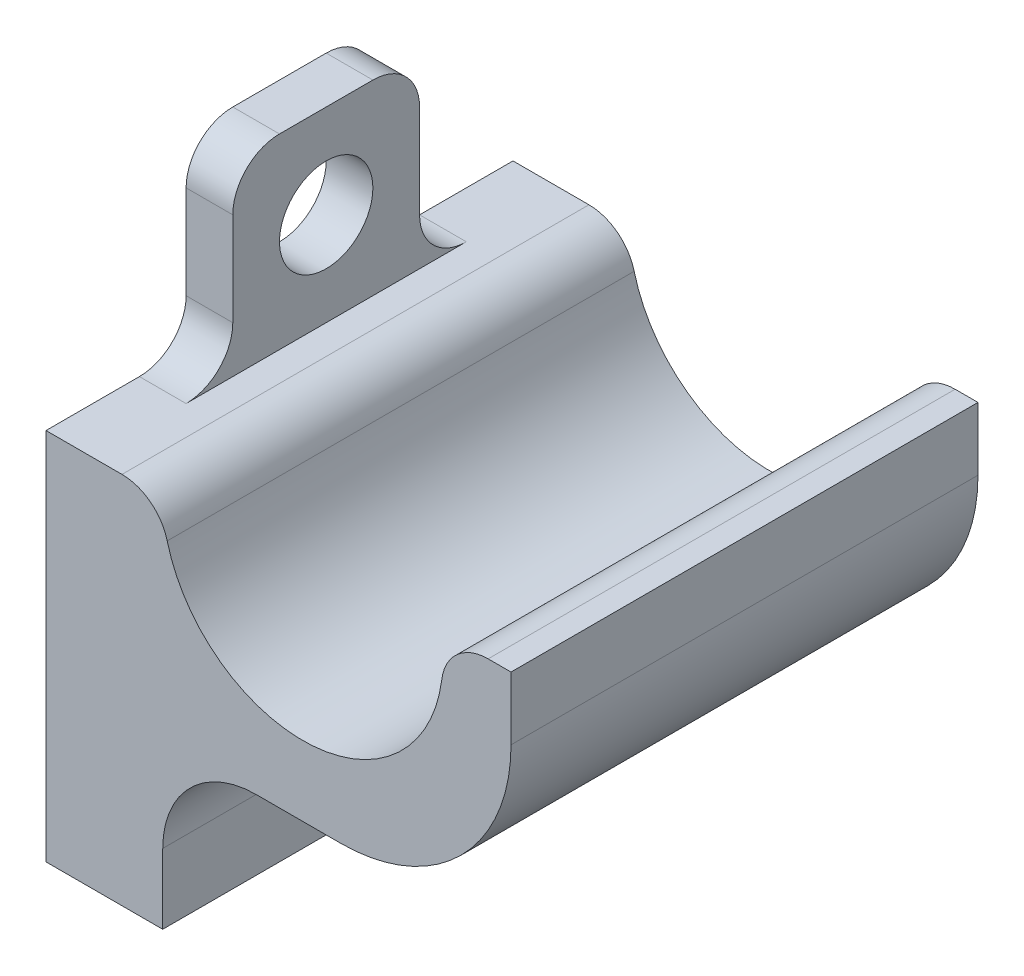
ISO-10303-21;
HEADER;
FILE_DESCRIPTION(('STEP AP214'),'2;1');
FILE_NAME('part.step','',(''),(''),'','','');
FILE_SCHEMA(('AUTOMOTIVE_DESIGN { 1 0 10303 214 1 1 1 1 }'));
ENDSEC;
DATA;
#1=APPLICATION_CONTEXT('core data for automotive mechanical design processes');
#2=APPLICATION_PROTOCOL_DEFINITION('international standard','automotive_design',2000,#1);
#3=PRODUCT_CONTEXT('',#1,'mechanical');
#4=PRODUCT('Part','Part','',(#3));
#5=PRODUCT_RELATED_PRODUCT_CATEGORY('part','',(#4));
#6=PRODUCT_DEFINITION_FORMATION('','',#4);
#7=PRODUCT_DEFINITION_CONTEXT('part definition',#1,'design');
#8=PRODUCT_DEFINITION('design','',#6,#7);
#9=PRODUCT_DEFINITION_SHAPE('','',#8);
#10=(LENGTH_UNIT() NAMED_UNIT(*) SI_UNIT(.MILLI.,.METRE.));
#11=(NAMED_UNIT(*) PLANE_ANGLE_UNIT() SI_UNIT($,.RADIAN.));
#12=(NAMED_UNIT(*) SI_UNIT($,.STERADIAN.) SOLID_ANGLE_UNIT());
#13=UNCERTAINTY_MEASURE_WITH_UNIT(LENGTH_MEASURE(1.E-05),#10,'distance_accuracy_value','');
#14=(GEOMETRIC_REPRESENTATION_CONTEXT(3) GLOBAL_UNCERTAINTY_ASSIGNED_CONTEXT((#13)) GLOBAL_UNIT_ASSIGNED_CONTEXT((#10,
#11,#12)) REPRESENTATION_CONTEXT('',''));
#15=CARTESIAN_POINT('',(0.,0.,0.));
#16=DIRECTION('',(0.,0.,1.));
#17=DIRECTION('',(1.,0.,0.));
#18=AXIS2_PLACEMENT_3D('',#15,#16,#17);
#19=CARTESIAN_POINT('',(23.9609708303066,20.3103702384589,-10.));
#20=DIRECTION('',(0.,1.,0.));
#21=DIRECTION('',(0.,0.,1.));
#22=AXIS2_PLACEMENT_3D('',#19,#20,#21);
#23=PLANE('',#22);
#24=DIRECTION('',(0.,0.,1.));
#25=VECTOR('',#24,1.);
#26=CARTESIAN_POINT('',(23.9609708303066,20.3103702384589,-10.));
#27=LINE('',#26,#25);
#28=CARTESIAN_POINT('',(23.9609708303066,20.3103702384589,-10.));
#29=VERTEX_POINT('',#28);
#30=CARTESIAN_POINT('',(23.9609708303066,20.3103702384589,-6.));
#31=VERTEX_POINT('',#30);
#32=EDGE_CURVE('E277',#29,#31,#27,.T.);
#33=ORIENTED_EDGE('',*,*,#32,.T.);
#34=DIRECTION('',(-1.,0.,0.));
#35=VECTOR('',#34,1.);
#36=CARTESIAN_POINT('',(23.9609708303066,20.3103702384589,-6.));
#37=LINE('',#36,#35);
#38=CARTESIAN_POINT('',(25.9609708303066,20.3103702384589,-6.));
#39=VERTEX_POINT('',#38);
#40=EDGE_CURVE('E352',#31,#39,#37,.F.);
#41=ORIENTED_EDGE('',*,*,#40,.T.);
#42=DIRECTION('',(0.,0.,-1.));
#43=VECTOR('',#42,1.);
#44=CARTESIAN_POINT('',(25.9609708303066,20.3103702384589,4.));
#45=LINE('',#44,#43);
#46=CARTESIAN_POINT('',(25.9609708303066,20.3103702384589,6.));
#47=VERTEX_POINT('',#46);
#48=EDGE_CURVE('E47',#47,#39,#45,.T.);
#49=ORIENTED_EDGE('',*,*,#48,.F.);
#50=DIRECTION('',(1.,0.,0.));
#51=VECTOR('',#50,1.);
#52=CARTESIAN_POINT('',(23.9609708303066,20.3103702384589,6.));
#53=LINE('',#52,#51);
#54=CARTESIAN_POINT('',(23.9609708303066,20.3103702384589,6.));
#55=VERTEX_POINT('',#54);
#56=EDGE_CURVE('E350',#47,#55,#53,.F.);
#57=ORIENTED_EDGE('',*,*,#56,.T.);
#58=CARTESIAN_POINT('',(23.9609708303066,20.3103702384589,10.));
#59=VERTEX_POINT('',#58);
#60=EDGE_CURVE('E280',#55,#59,#27,.T.);
#61=ORIENTED_EDGE('',*,*,#60,.T.);
#62=DIRECTION('',(-1.,0.,0.));
#63=VECTOR('',#62,1.);
#64=CARTESIAN_POINT('',(23.9609708303066,20.3103702384589,10.));
#65=LINE('',#64,#63);
#66=CARTESIAN_POINT('',(27.2150041378918,20.3103702384589,10.));
#67=VERTEX_POINT('',#66);
#68=EDGE_CURVE('E248',#67,#59,#65,.T.);
#69=ORIENTED_EDGE('',*,*,#68,.F.);
#70=DIRECTION('',(0.,0.,1.));
#71=VECTOR('',#70,1.);
#72=CARTESIAN_POINT('',(27.2150041378918,20.3103702384589,-10.));
#73=LINE('',#72,#71);
#74=CARTESIAN_POINT('',(27.2150041378918,20.3103702384589,-10.));
#75=VERTEX_POINT('',#74);
#76=EDGE_CURVE('E317',#67,#75,#73,.F.);
#77=ORIENTED_EDGE('',*,*,#76,.T.);
#78=DIRECTION('',(-1.,0.,0.));
#79=VECTOR('',#78,1.);
#80=CARTESIAN_POINT('',(23.9609708303066,20.3103702384589,-10.));
#81=LINE('',#80,#79);
#82=EDGE_CURVE('E270',#75,#29,#81,.T.);
#83=ORIENTED_EDGE('',*,*,#82,.T.);
#84=EDGE_LOOP('',(#33,#41,#49,#57,#61,#69,#77,#83));
#85=FACE_BOUND('',#84,.T.);
#86=ADVANCED_FACE('F32',(#85),#23,.T.);
#87=CARTESIAN_POINT('',(28.9609708303066,4.31037023845893,-10.));
#88=DIRECTION('',(1.,0.,0.));
#89=DIRECTION('',(0.,0.,-1.));
#90=AXIS2_PLACEMENT_3D('',#87,#88,#89);
#91=PLANE('',#90);
#92=DIRECTION('',(0.,-1.,0.));
#93=VECTOR('',#92,1.);
#94=CARTESIAN_POINT('',(28.9609708303066,4.31037023845893,2.));
#95=LINE('',#94,#93);
#96=CARTESIAN_POINT('',(28.9609708303066,7.31037023845893,2.));
#97=VERTEX_POINT('',#96);
#98=CARTESIAN_POINT('',(28.9609708303066,4.31037023845893,2.));
#99=VERTEX_POINT('',#98);
#100=EDGE_CURVE('E189',#97,#99,#95,.T.);
#101=ORIENTED_EDGE('',*,*,#100,.F.);
#102=DIRECTION('',(0.,0.,1.));
#103=VECTOR('',#102,1.);
#104=CARTESIAN_POINT('',(28.9609708303066,7.31037023845893,10.));
#105=LINE('',#104,#103);
#106=CARTESIAN_POINT('',(28.9609708303066,7.31037023845893,10.));
#107=VERTEX_POINT('',#106);
#108=EDGE_CURVE('E292',#97,#107,#105,.T.);
#109=ORIENTED_EDGE('',*,*,#108,.T.);
#110=DIRECTION('',(0.,1.,0.));
#111=VECTOR('',#110,1.);
#112=CARTESIAN_POINT('',(28.9609708303066,4.31037023845893,10.));
#113=LINE('',#112,#111);
#114=CARTESIAN_POINT('',(28.9609708303066,4.31037023845893,10.));
#115=VERTEX_POINT('',#114);
#116=EDGE_CURVE('E218',#115,#107,#113,.T.);
#117=ORIENTED_EDGE('',*,*,#116,.F.);
#118=DIRECTION('',(0.,0.,1.));
#119=VECTOR('',#118,1.);
#120=CARTESIAN_POINT('',(28.9609708303066,4.31037023845893,-10.));
#121=LINE('',#120,#119);
#122=EDGE_CURVE('E215',#99,#115,#121,.T.);
#123=ORIENTED_EDGE('',*,*,#122,.F.);
#124=EDGE_LOOP('',(#101,#109,#117,#123));
#125=FACE_BOUND('',#124,.T.);
#126=ADVANCED_FACE('F216',(#125),#91,.T.);
#127=CARTESIAN_POINT('',(23.9609708303066,4.31037023845893,-10.));
#128=DIRECTION('',(0.,-1.,0.));
#129=DIRECTION('',(0.,0.,-1.));
#130=AXIS2_PLACEMENT_3D('',#127,#128,#129);
#131=PLANE('',#130);
#132=CARTESIAN_POINT('',(28.9609708303066,4.31037023845893,-10.));
#133=VERTEX_POINT('',#132);
#134=CARTESIAN_POINT('',(28.9609708303066,4.31037023845893,-2.));
#135=VERTEX_POINT('',#134);
#136=EDGE_CURVE('E222',#133,#135,#121,.T.);
#137=ORIENTED_EDGE('',*,*,#136,.T.);
#138=DIRECTION('',(0.,0.,1.));
#139=VECTOR('',#138,1.);
#140=CARTESIAN_POINT('',(28.9609708303066,4.31037023845893,-2.));
#141=LINE('',#140,#139);
#142=EDGE_CURVE('E208',#135,#99,#141,.T.);
#143=ORIENTED_EDGE('',*,*,#142,.T.);
#144=ORIENTED_EDGE('',*,*,#122,.T.);
#145=DIRECTION('',(1.,0.,0.));
#146=VECTOR('',#145,1.);
#147=CARTESIAN_POINT('',(23.9609708303066,4.31037023845893,10.));
#148=LINE('',#147,#146);
#149=CARTESIAN_POINT('',(23.9609708303066,4.31037023845893,10.));
#150=VERTEX_POINT('',#149);
#151=EDGE_CURVE('E230',#150,#115,#148,.T.);
#152=ORIENTED_EDGE('',*,*,#151,.F.);
#153=DIRECTION('',(0.,0.,1.));
#154=VECTOR('',#153,1.);
#155=CARTESIAN_POINT('',(23.9609708303066,4.31037023845893,-10.));
#156=LINE('',#155,#154);
#157=CARTESIAN_POINT('',(23.9609708303066,4.31037023845893,-10.));
#158=VERTEX_POINT('',#157);
#159=EDGE_CURVE('E274',#158,#150,#156,.T.);
#160=ORIENTED_EDGE('',*,*,#159,.F.);
#161=DIRECTION('',(1.,0.,0.));
#162=VECTOR('',#161,1.);
#163=CARTESIAN_POINT('',(23.9609708303066,4.31037023845893,-10.));
#164=LINE('',#163,#162);
#165=EDGE_CURVE('E254',#158,#133,#164,.T.);
#166=ORIENTED_EDGE('',*,*,#165,.T.);
#167=EDGE_LOOP('',(#137,#143,#144,#152,#160,#166));
#168=FACE_BOUND('',#167,.T.);
#169=ADVANCED_FACE('F226',(#168),#131,.T.);
#170=CARTESIAN_POINT('',(23.9609708303066,4.31037023845893,-10.));
#171=DIRECTION('',(-1.,0.,0.));
#172=DIRECTION('',(0.,0.,1.));
#173=AXIS2_PLACEMENT_3D('',#170,#171,#172);
#174=PLANE('',#173);
#175=CARTESIAN_POINT('',(23.9609708303066,24.3103702384589,0.));
#176=DIRECTION('',(-1.,0.,0.));
#177=DIRECTION('',(0.,0.,1.));
#178=AXIS2_PLACEMENT_3D('',#175,#176,#177);
#179=CIRCLE('',#178,2.);
#180=CARTESIAN_POINT('',(23.9609708303066,24.3103702384589,2.));
#181=VERTEX_POINT('',#180);
#182=EDGE_CURVE('E688',#181,#181,#179,.F.);
#183=ORIENTED_EDGE('',*,*,#182,.T.);
#184=EDGE_LOOP('',(#183));
#185=FACE_BOUND('',#184,.T.);
#186=DIRECTION('',(0.,-1.,0.));
#187=VECTOR('',#186,1.);
#188=CARTESIAN_POINT('',(23.9609708303066,28.3103702384589,4.));
#189=LINE('',#188,#187);
#190=CARTESIAN_POINT('',(23.9609708303066,26.3103702384589,4.));
#191=VERTEX_POINT('',#190);
#192=CARTESIAN_POINT('',(23.9609708303066,22.3103702384589,4.));
#193=VERTEX_POINT('',#192);
#194=EDGE_CURVE('E399',#191,#193,#189,.T.);
#195=ORIENTED_EDGE('',*,*,#194,.F.);
#196=CARTESIAN_POINT('',(23.9609708303066,26.3103702384589,2.));
#197=DIRECTION('',(-1.,0.,0.));
#198=DIRECTION('',(0.,0.,1.));
#199=AXIS2_PLACEMENT_3D('',#196,#197,#198);
#200=CIRCLE('',#199,2.);
#201=CARTESIAN_POINT('',(23.9609708303066,28.3103702384589,2.));
#202=VERTEX_POINT('',#201);
#203=EDGE_CURVE('E343',#191,#202,#200,.T.);
#204=ORIENTED_EDGE('',*,*,#203,.T.);
#205=DIRECTION('',(0.,0.,1.));
#206=VECTOR('',#205,1.);
#207=CARTESIAN_POINT('',(23.9609708303066,28.3103702384589,-4.));
#208=LINE('',#207,#206);
#209=CARTESIAN_POINT('',(23.9609708303066,28.3103702384589,-2.));
#210=VERTEX_POINT('',#209);
#211=EDGE_CURVE('E699',#210,#202,#208,.T.);
#212=ORIENTED_EDGE('',*,*,#211,.F.);
#213=CARTESIAN_POINT('',(23.9609708303066,26.3103702384589,-2.));
#214=DIRECTION('',(-1.,0.,0.));
#215=DIRECTION('',(0.,0.,1.));
#216=AXIS2_PLACEMENT_3D('',#213,#214,#215);
#217=CIRCLE('',#216,2.);
#218=CARTESIAN_POINT('',(23.9609708303066,26.3103702384589,-4.));
#219=VERTEX_POINT('',#218);
#220=EDGE_CURVE('E341',#210,#219,#217,.T.);
#221=ORIENTED_EDGE('',*,*,#220,.T.);
#222=DIRECTION('',(0.,-1.,0.));
#223=VECTOR('',#222,1.);
#224=CARTESIAN_POINT('',(23.9609708303066,28.3103702384589,-4.));
#225=LINE('',#224,#223);
#226=CARTESIAN_POINT('',(23.9609708303066,22.3103702384589,-4.));
#227=VERTEX_POINT('',#226);
#228=EDGE_CURVE('E396',#219,#227,#225,.T.);
#229=ORIENTED_EDGE('',*,*,#228,.T.);
#230=CARTESIAN_POINT('',(23.9609708303066,22.3103702384589,-6.));
#231=DIRECTION('',(-1.,0.,0.));
#232=DIRECTION('',(0.,0.,1.));
#233=AXIS2_PLACEMENT_3D('',#230,#231,#232);
#234=CIRCLE('',#233,2.);
#235=EDGE_CURVE('E354',#227,#31,#234,.F.);
#236=ORIENTED_EDGE('',*,*,#235,.T.);
#237=ORIENTED_EDGE('',*,*,#32,.F.);
#238=DIRECTION('',(0.,-1.,0.));
#239=VECTOR('',#238,1.);
#240=CARTESIAN_POINT('',(23.9609708303066,4.31037023845893,-10.));
#241=LINE('',#240,#239);
#242=EDGE_CURVE('E223',#29,#158,#241,.T.);
#243=ORIENTED_EDGE('',*,*,#242,.T.);
#244=ORIENTED_EDGE('',*,*,#159,.T.);
#245=DIRECTION('',(0.,-1.,0.));
#246=VECTOR('',#245,1.);
#247=CARTESIAN_POINT('',(23.9609708303066,4.31037023845893,10.));
#248=LINE('',#247,#246);
#249=EDGE_CURVE('E251',#59,#150,#248,.T.);
#250=ORIENTED_EDGE('',*,*,#249,.F.);
#251=ORIENTED_EDGE('',*,*,#60,.F.);
#252=CARTESIAN_POINT('',(23.9609708303066,22.3103702384589,6.));
#253=DIRECTION('',(-1.,0.,0.));
#254=DIRECTION('',(0.,0.,1.));
#255=AXIS2_PLACEMENT_3D('',#252,#253,#254);
#256=CIRCLE('',#255,2.);
#257=EDGE_CURVE('E11',#55,#193,#256,.F.);
#258=ORIENTED_EDGE('',*,*,#257,.T.);
#259=EDGE_LOOP('',(#195,#204,#212,#221,#229,#236,#237,#243,#244,#250,#251,#258));
#260=FACE_BOUND('',#259,.T.);
#261=ADVANCED_FACE('F371',(#185,#260),#174,.T.);
#262=CARTESIAN_POINT('',(34.9609708303066,20.3103702384589,-10.));
#263=DIRECTION('',(0.,0.,1.));
#264=DIRECTION('',(1.,0.,0.));
#265=AXIS2_PLACEMENT_3D('',#262,#263,#264);
#266=CYLINDRICAL_SURFACE('',#265,6.);
#267=CARTESIAN_POINT('',(34.9609708303066,20.3103702384589,-10.));
#268=DIRECTION('',(0.,0.,-1.));
#269=DIRECTION('',(1.,0.,0.));
#270=AXIS2_PLACEMENT_3D('',#267,#268,#269);
#271=CIRCLE('',#270,6.);
#272=CARTESIAN_POINT('',(40.9139112802019,19.5603702384589,-10.));
#273=VERTEX_POINT('',#272);
#274=CARTESIAN_POINT('',(29.1514958109955,18.8103702384589,-10.));
#275=VERTEX_POINT('',#274);
#276=EDGE_CURVE('E267',#273,#275,#271,.T.);
#277=ORIENTED_EDGE('',*,*,#276,.T.);
#278=DIRECTION('',(0.,0.,1.));
#279=VECTOR('',#278,1.);
#280=CARTESIAN_POINT('',(29.1514958109955,18.8103702384589,-10.));
#281=LINE('',#280,#279);
#282=CARTESIAN_POINT('',(29.1514958109955,18.8103702384589,10.));
#283=VERTEX_POINT('',#282);
#284=EDGE_CURVE('E310',#275,#283,#281,.T.);
#285=ORIENTED_EDGE('',*,*,#284,.T.);
#286=CARTESIAN_POINT('',(34.9609708303066,20.3103702384589,10.));
#287=DIRECTION('',(0.,0.,-1.));
#288=DIRECTION('',(1.,0.,0.));
#289=AXIS2_PLACEMENT_3D('',#286,#287,#288);
#290=CIRCLE('',#289,6.);
#291=CARTESIAN_POINT('',(40.9139112802019,19.5603702384589,10.));
#292=VERTEX_POINT('',#291);
#293=EDGE_CURVE('E245',#292,#283,#290,.T.);
#294=ORIENTED_EDGE('',*,*,#293,.F.);
#295=DIRECTION('',(0.,0.,1.));
#296=VECTOR('',#295,1.);
#297=CARTESIAN_POINT('',(40.9139112802019,19.5603702384589,-10.));
#298=LINE('',#297,#296);
#299=EDGE_CURVE('E308',#292,#273,#298,.F.);
#300=ORIENTED_EDGE('',*,*,#299,.T.);
#301=EDGE_LOOP('',(#277,#285,#294,#300));
#302=FACE_BOUND('',#301,.T.);
#303=ADVANCED_FACE('F438',(#302),#266,.F.);
#304=CARTESIAN_POINT('',(40.8770506134062,21.3103702384589,-10.));
#305=DIRECTION('',(0.,1.,0.));
#306=DIRECTION('',(0.,0.,1.));
#307=AXIS2_PLACEMENT_3D('',#304,#305,#306);
#308=PLANE('',#307);
#309=DIRECTION('',(-1.,0.,0.));
#310=VECTOR('',#309,1.);
#311=CARTESIAN_POINT('',(40.8770506134062,21.3103702384589,-10.));
#312=LINE('',#311,#310);
#313=CARTESIAN_POINT('',(43.8770506134062,21.3103702384589,-10.));
#314=VERTEX_POINT('',#313);
#315=CARTESIAN_POINT('',(42.8982247635004,21.3103702384589,-10.));
#316=VERTEX_POINT('',#315);
#317=EDGE_CURVE('E264',#314,#316,#312,.T.);
#318=ORIENTED_EDGE('',*,*,#317,.T.);
#319=DIRECTION('',(0.,0.,1.));
#320=VECTOR('',#319,1.);
#321=CARTESIAN_POINT('',(42.8982247635004,21.3103702384589,-10.));
#322=LINE('',#321,#320);
#323=CARTESIAN_POINT('',(42.8982247635004,21.3103702384589,10.));
#324=VERTEX_POINT('',#323);
#325=EDGE_CURVE('E323',#316,#324,#322,.T.);
#326=ORIENTED_EDGE('',*,*,#325,.T.);
#327=DIRECTION('',(-1.,0.,0.));
#328=VECTOR('',#327,1.);
#329=CARTESIAN_POINT('',(40.8770506134062,21.3103702384589,10.));
#330=LINE('',#329,#328);
#331=CARTESIAN_POINT('',(43.8770506134062,21.3103702384589,10.));
#332=VERTEX_POINT('',#331);
#333=EDGE_CURVE('E242',#332,#324,#330,.T.);
#334=ORIENTED_EDGE('',*,*,#333,.F.);
#335=DIRECTION('',(0.,0.,1.));
#336=VECTOR('',#335,1.);
#337=CARTESIAN_POINT('',(43.8770506134062,21.3103702384589,-10.));
#338=LINE('',#337,#336);
#339=EDGE_CURVE('E281',#314,#332,#338,.T.);
#340=ORIENTED_EDGE('',*,*,#339,.F.);
#341=EDGE_LOOP('',(#318,#326,#334,#340));
#342=FACE_BOUND('',#341,.T.);
#343=ADVANCED_FACE('F432',(#342),#308,.T.);
#344=CARTESIAN_POINT('',(43.8770506134062,11.3103702384589,-10.));
#345=DIRECTION('',(1.,0.,0.));
#346=DIRECTION('',(0.,0.,-1.));
#347=AXIS2_PLACEMENT_3D('',#344,#345,#346);
#348=PLANE('',#347);
#349=DIRECTION('',(0.,1.,0.));
#350=VECTOR('',#349,1.);
#351=CARTESIAN_POINT('',(43.8770506134062,11.3103702384589,10.));
#352=LINE('',#351,#350);
#353=CARTESIAN_POINT('',(43.8770506134062,18.6103702384589,10.));
#354=VERTEX_POINT('',#353);
#355=EDGE_CURVE('E240',#354,#332,#352,.T.);
#356=ORIENTED_EDGE('',*,*,#355,.F.);
#357=DIRECTION('',(0.,0.,1.));
#358=VECTOR('',#357,1.);
#359=CARTESIAN_POINT('',(43.8770506134062,18.6103702384589,-10.));
#360=LINE('',#359,#358);
#361=CARTESIAN_POINT('',(43.8770506134062,18.6103702384589,-10.));
#362=VERTEX_POINT('',#361);
#363=EDGE_CURVE('E304',#354,#362,#360,.F.);
#364=ORIENTED_EDGE('',*,*,#363,.T.);
#365=DIRECTION('',(0.,1.,0.));
#366=VECTOR('',#365,1.);
#367=CARTESIAN_POINT('',(43.8770506134062,11.3103702384589,-10.));
#368=LINE('',#367,#366);
#369=EDGE_CURVE('E262',#362,#314,#368,.T.);
#370=ORIENTED_EDGE('',*,*,#369,.T.);
#371=ORIENTED_EDGE('',*,*,#339,.T.);
#372=EDGE_LOOP('',(#356,#364,#370,#371));
#373=FACE_BOUND('',#372,.T.);
#374=ADVANCED_FACE('F426',(#373),#348,.T.);
#375=CARTESIAN_POINT('',(28.9609708303066,11.3103702384589,-10.));
#376=DIRECTION('',(0.,-1.,0.));
#377=DIRECTION('',(0.,0.,-1.));
#378=AXIS2_PLACEMENT_3D('',#375,#376,#377);
#379=PLANE('',#378);
#380=DIRECTION('',(1.,0.,0.));
#381=VECTOR('',#380,1.);
#382=CARTESIAN_POINT('',(28.9609708303066,11.3103702384589,-10.));
#383=LINE('',#382,#381);
#384=CARTESIAN_POINT('',(32.9609708303066,11.3103702384589,-10.));
#385=VERTEX_POINT('',#384);
#386=CARTESIAN_POINT('',(36.5770506134062,11.3103702384589,-10.));
#387=VERTEX_POINT('',#386);
#388=EDGE_CURVE('E259',#385,#387,#383,.T.);
#389=ORIENTED_EDGE('',*,*,#388,.T.);
#390=DIRECTION('',(0.,0.,1.));
#391=VECTOR('',#390,1.);
#392=CARTESIAN_POINT('',(36.5770506134062,11.3103702384589,-10.));
#393=LINE('',#392,#391);
#394=CARTESIAN_POINT('',(36.5770506134062,11.3103702384589,10.));
#395=VERTEX_POINT('',#394);
#396=EDGE_CURVE('E299',#387,#395,#393,.T.);
#397=ORIENTED_EDGE('',*,*,#396,.T.);
#398=DIRECTION('',(1.,0.,0.));
#399=VECTOR('',#398,1.);
#400=CARTESIAN_POINT('',(28.9609708303066,11.3103702384589,10.));
#401=LINE('',#400,#399);
#402=CARTESIAN_POINT('',(32.9609708303066,11.3103702384589,10.));
#403=VERTEX_POINT('',#402);
#404=EDGE_CURVE('E237',#403,#395,#401,.T.);
#405=ORIENTED_EDGE('',*,*,#404,.F.);
#406=DIRECTION('',(0.,0.,1.));
#407=VECTOR('',#406,1.);
#408=CARTESIAN_POINT('',(32.9609708303066,11.3103702384589,2.));
#409=LINE('',#408,#407);
#410=CARTESIAN_POINT('',(32.9609708303066,11.3103702384589,2.));
#411=VERTEX_POINT('',#410);
#412=EDGE_CURVE('E288',#403,#411,#409,.F.);
#413=ORIENTED_EDGE('',*,*,#412,.T.);
#414=DIRECTION('',(-1.,0.,0.));
#415=VECTOR('',#414,1.);
#416=CARTESIAN_POINT('',(36.4190107218564,11.3103702384589,2.));
#417=LINE('',#416,#415);
#418=CARTESIAN_POINT('',(36.4190107218564,11.3103702384589,2.));
#419=VERTEX_POINT('',#418);
#420=EDGE_CURVE('E201',#419,#411,#417,.T.);
#421=ORIENTED_EDGE('',*,*,#420,.F.);
#422=DIRECTION('',(0.,0.,1.));
#423=VECTOR('',#422,1.);
#424=CARTESIAN_POINT('',(36.4190107218564,11.3103702384589,-2.));
#425=LINE('',#424,#423);
#426=CARTESIAN_POINT('',(36.4190107218564,11.3103702384589,-2.));
#427=VERTEX_POINT('',#426);
#428=EDGE_CURVE('E211',#427,#419,#425,.T.);
#429=ORIENTED_EDGE('',*,*,#428,.F.);
#430=DIRECTION('',(-1.,0.,0.));
#431=VECTOR('',#430,1.);
#432=CARTESIAN_POINT('',(36.4190107218564,11.3103702384589,-2.));
#433=LINE('',#432,#431);
#434=CARTESIAN_POINT('',(32.9609708303066,11.3103702384589,-2.));
#435=VERTEX_POINT('',#434);
#436=EDGE_CURVE('E212',#427,#435,#433,.T.);
#437=ORIENTED_EDGE('',*,*,#436,.T.);
#438=DIRECTION('',(0.,0.,1.));
#439=VECTOR('',#438,1.);
#440=CARTESIAN_POINT('',(32.9609708303066,11.3103702384589,-10.));
#441=LINE('',#440,#439);
#442=EDGE_CURVE('E290',#435,#385,#441,.F.);
#443=ORIENTED_EDGE('',*,*,#442,.T.);
#444=EDGE_LOOP('',(#389,#397,#405,#413,#421,#429,#437,#443));
#445=FACE_BOUND('',#444,.T.);
#446=ADVANCED_FACE('F412',(#445),#379,.T.);
#447=DIRECTION('',(0.,1.,0.));
#448=VECTOR('',#447,1.);
#449=CARTESIAN_POINT('',(28.9609708303066,4.31037023845893,-10.));
#450=LINE('',#449,#448);
#451=CARTESIAN_POINT('',(28.9609708303066,7.31037023845893,-10.));
#452=VERTEX_POINT('',#451);
#453=EDGE_CURVE('E256',#133,#452,#450,.T.);
#454=ORIENTED_EDGE('',*,*,#453,.T.);
#455=DIRECTION('',(0.,0.,1.));
#456=VECTOR('',#455,1.);
#457=CARTESIAN_POINT('',(28.9609708303066,7.31037023845893,-2.));
#458=LINE('',#457,#456);
#459=CARTESIAN_POINT('',(28.9609708303066,7.31037023845893,-2.));
#460=VERTEX_POINT('',#459);
#461=EDGE_CURVE('E276',#452,#460,#458,.T.);
#462=ORIENTED_EDGE('',*,*,#461,.T.);
#463=DIRECTION('',(0.,-1.,0.));
#464=VECTOR('',#463,1.);
#465=CARTESIAN_POINT('',(28.9609708303066,4.31037023845893,-2.));
#466=LINE('',#465,#464);
#467=EDGE_CURVE('E232',#460,#135,#466,.T.);
#468=ORIENTED_EDGE('',*,*,#467,.T.);
#469=ORIENTED_EDGE('',*,*,#136,.F.);
#470=EDGE_LOOP('',(#454,#462,#468,#469));
#471=FACE_BOUND('',#470,.T.);
#472=ADVANCED_FACE('F407',(#471),#91,.T.);
#473=CARTESIAN_POINT('',(34.9609708303066,20.3103702384589,-10.));
#474=DIRECTION('',(0.,0.,1.));
#475=DIRECTION('',(1.,0.,0.));
#476=AXIS2_PLACEMENT_3D('',#473,#474,#475);
#477=PLANE('',#476);
#478=ORIENTED_EDGE('',*,*,#82,.F.);
#479=CARTESIAN_POINT('',(27.2150041378918,18.3103702384589,-10.));
#480=DIRECTION('',(0.,0.,1.));
#481=DIRECTION('',(1.,0.,0.));
#482=AXIS2_PLACEMENT_3D('',#479,#480,#481);
#483=CIRCLE('',#482,2.);
#484=EDGE_CURVE('E321',#75,#275,#483,.F.);
#485=ORIENTED_EDGE('',*,*,#484,.T.);
#486=ORIENTED_EDGE('',*,*,#276,.F.);
#487=CARTESIAN_POINT('',(42.8982247635004,19.3103702384589,-10.));
#488=DIRECTION('',(0.,0.,1.));
#489=DIRECTION('',(1.,0.,0.));
#490=AXIS2_PLACEMENT_3D('',#487,#488,#489);
#491=CIRCLE('',#490,2.);
#492=EDGE_CURVE('E319',#273,#316,#491,.F.);
#493=ORIENTED_EDGE('',*,*,#492,.T.);
#494=ORIENTED_EDGE('',*,*,#317,.F.);
#495=ORIENTED_EDGE('',*,*,#369,.F.);
#496=CARTESIAN_POINT('',(36.5770506134062,18.6103702384589,-10.));
#497=DIRECTION('',(0.,0.,1.));
#498=DIRECTION('',(1.,0.,0.));
#499=AXIS2_PLACEMENT_3D('',#496,#497,#498);
#500=CIRCLE('',#499,7.3);
#501=EDGE_CURVE('E306',#362,#387,#500,.F.);
#502=ORIENTED_EDGE('',*,*,#501,.T.);
#503=ORIENTED_EDGE('',*,*,#388,.F.);
#504=CARTESIAN_POINT('',(32.9609708303066,7.31037023845893,-10.));
#505=DIRECTION('',(0.,0.,1.));
#506=DIRECTION('',(1.,0.,0.));
#507=AXIS2_PLACEMENT_3D('',#504,#505,#506);
#508=CIRCLE('',#507,4.);
#509=EDGE_CURVE('E295',#385,#452,#508,.T.);
#510=ORIENTED_EDGE('',*,*,#509,.T.);
#511=ORIENTED_EDGE('',*,*,#453,.F.);
#512=ORIENTED_EDGE('',*,*,#165,.F.);
#513=ORIENTED_EDGE('',*,*,#242,.F.);
#514=EDGE_LOOP('',(#478,#485,#486,#493,#494,#495,#502,#503,#510,#511,#512,#513));
#515=FACE_BOUND('',#514,.T.);
#516=ADVANCED_FACE('F380',(#515),#477,.F.);
#517=CARTESIAN_POINT('',(34.9609708303066,20.3103702384589,10.));
#518=DIRECTION('',(0.,0.,1.));
#519=DIRECTION('',(1.,0.,0.));
#520=AXIS2_PLACEMENT_3D('',#517,#518,#519);
#521=PLANE('',#520);
#522=ORIENTED_EDGE('',*,*,#293,.T.);
#523=CARTESIAN_POINT('',(27.2150041378918,18.3103702384589,10.));
#524=DIRECTION('',(0.,0.,1.));
#525=DIRECTION('',(1.,0.,0.));
#526=AXIS2_PLACEMENT_3D('',#523,#524,#525);
#527=CIRCLE('',#526,2.);
#528=EDGE_CURVE('E315',#283,#67,#527,.T.);
#529=ORIENTED_EDGE('',*,*,#528,.T.);
#530=ORIENTED_EDGE('',*,*,#68,.T.);
#531=ORIENTED_EDGE('',*,*,#249,.T.);
#532=ORIENTED_EDGE('',*,*,#151,.T.);
#533=ORIENTED_EDGE('',*,*,#116,.T.);
#534=CARTESIAN_POINT('',(32.9609708303066,7.31037023845893,10.));
#535=DIRECTION('',(0.,0.,1.));
#536=DIRECTION('',(1.,0.,0.));
#537=AXIS2_PLACEMENT_3D('',#534,#535,#536);
#538=CIRCLE('',#537,4.);
#539=EDGE_CURVE('E297',#107,#403,#538,.F.);
#540=ORIENTED_EDGE('',*,*,#539,.T.);
#541=ORIENTED_EDGE('',*,*,#404,.T.);
#542=CARTESIAN_POINT('',(36.5770506134062,18.6103702384589,10.));
#543=DIRECTION('',(0.,0.,1.));
#544=DIRECTION('',(1.,0.,0.));
#545=AXIS2_PLACEMENT_3D('',#542,#543,#544);
#546=CIRCLE('',#545,7.3);
#547=EDGE_CURVE('E302',#395,#354,#546,.T.);
#548=ORIENTED_EDGE('',*,*,#547,.T.);
#549=ORIENTED_EDGE('',*,*,#355,.T.);
#550=ORIENTED_EDGE('',*,*,#333,.T.);
#551=CARTESIAN_POINT('',(42.8982247635004,19.3103702384589,10.));
#552=DIRECTION('',(0.,0.,1.));
#553=DIRECTION('',(1.,0.,0.));
#554=AXIS2_PLACEMENT_3D('',#551,#552,#553);
#555=CIRCLE('',#554,2.);
#556=EDGE_CURVE('E313',#324,#292,#555,.T.);
#557=ORIENTED_EDGE('',*,*,#556,.T.);
#558=EDGE_LOOP('',(#522,#529,#530,#531,#532,#533,#540,#541,#548,#549,#550,#557));
#559=FACE_BOUND('',#558,.T.);
#560=ADVANCED_FACE('F374',(#559),#521,.T.);
#561=CARTESIAN_POINT('',(36.4190107218564,11.3103702384589,-2.));
#562=DIRECTION('',(0.684361840922293,-0.729142558550418,0.));
#563=DIRECTION('',(0.729142558550418,0.684361840922293,0.));
#564=AXIS2_PLACEMENT_3D('',#561,#562,#563);
#565=PLANE('',#564);
#566=ORIENTED_EDGE('',*,*,#428,.T.);
#567=DIRECTION('',(0.729142558550418,0.684361840922293,0.));
#568=VECTOR('',#567,1.);
#569=CARTESIAN_POINT('',(36.4190107218564,11.3103702384589,2.));
#570=LINE('',#569,#568);
#571=EDGE_CURVE('E193',#99,#419,#570,.T.);
#572=ORIENTED_EDGE('',*,*,#571,.F.);
#573=ORIENTED_EDGE('',*,*,#142,.F.);
#574=DIRECTION('',(0.729142558550418,0.684361840922293,0.));
#575=VECTOR('',#574,1.);
#576=CARTESIAN_POINT('',(36.4190107218564,11.3103702384589,-2.));
#577=LINE('',#576,#575);
#578=EDGE_CURVE('E228',#135,#427,#577,.T.);
#579=ORIENTED_EDGE('',*,*,#578,.T.);
#580=EDGE_LOOP('',(#566,#572,#573,#579));
#581=FACE_BOUND('',#580,.T.);
#582=ADVANCED_FACE('F205',(#581),#565,.T.);
#583=CARTESIAN_POINT('',(0.,0.,-2.));
#584=DIRECTION('',(0.,0.,-1.));
#585=DIRECTION('',(-1.,0.,0.));
#586=AXIS2_PLACEMENT_3D('',#583,#584,#585);
#587=PLANE('',#586);
#588=ORIENTED_EDGE('',*,*,#467,.F.);
#589=CARTESIAN_POINT('',(32.9609708303066,7.31037023845893,-2.));
#590=DIRECTION('',(0.,0.,-1.));
#591=DIRECTION('',(-1.,0.,0.));
#592=AXIS2_PLACEMENT_3D('',#589,#590,#591);
#593=CIRCLE('',#592,4.);
#594=EDGE_CURVE('E286',#460,#435,#593,.T.);
#595=ORIENTED_EDGE('',*,*,#594,.T.);
#596=ORIENTED_EDGE('',*,*,#436,.F.);
#597=ORIENTED_EDGE('',*,*,#578,.F.);
#598=EDGE_LOOP('',(#588,#595,#596,#597));
#599=FACE_BOUND('',#598,.T.);
#600=ADVANCED_FACE('F410',(#599),#587,.T.);
#601=CARTESIAN_POINT('',(0.,0.,2.));
#602=DIRECTION('',(0.,0.,-1.));
#603=DIRECTION('',(-1.,0.,0.));
#604=AXIS2_PLACEMENT_3D('',#601,#602,#603);
#605=PLANE('',#604);
#606=ORIENTED_EDGE('',*,*,#420,.T.);
#607=CARTESIAN_POINT('',(32.9609708303066,7.31037023845893,2.));
#608=DIRECTION('',(0.,0.,-1.));
#609=DIRECTION('',(-1.,0.,0.));
#610=AXIS2_PLACEMENT_3D('',#607,#608,#609);
#611=CIRCLE('',#610,4.);
#612=EDGE_CURVE('E196',#411,#97,#611,.F.);
#613=ORIENTED_EDGE('',*,*,#612,.T.);
#614=ORIENTED_EDGE('',*,*,#100,.T.);
#615=ORIENTED_EDGE('',*,*,#571,.T.);
#616=EDGE_LOOP('',(#606,#613,#614,#615));
#617=FACE_BOUND('',#616,.T.);
#618=ADVANCED_FACE('F192',(#617),#605,.F.);
#619=CARTESIAN_POINT('',(32.9609708303066,7.31037023845893,-10.));
#620=DIRECTION('',(0.,0.,-1.));
#621=DIRECTION('',(-1.,0.,0.));
#622=AXIS2_PLACEMENT_3D('',#619,#620,#621);
#623=CYLINDRICAL_SURFACE('',#622,4.);
#624=ORIENTED_EDGE('',*,*,#509,.F.);
#625=ORIENTED_EDGE('',*,*,#442,.F.);
#626=ORIENTED_EDGE('',*,*,#594,.F.);
#627=ORIENTED_EDGE('',*,*,#461,.F.);
#628=EDGE_LOOP('',(#624,#625,#626,#627));
#629=FACE_BOUND('',#628,.T.);
#630=ADVANCED_FACE('F475',(#629),#623,.F.);
#631=CARTESIAN_POINT('',(32.9609708303066,7.31037023845893,-10.));
#632=DIRECTION('',(0.,0.,-1.));
#633=DIRECTION('',(-1.,0.,0.));
#634=AXIS2_PLACEMENT_3D('',#631,#632,#633);
#635=CYLINDRICAL_SURFACE('',#634,4.);
#636=ORIENTED_EDGE('',*,*,#612,.F.);
#637=ORIENTED_EDGE('',*,*,#412,.F.);
#638=ORIENTED_EDGE('',*,*,#539,.F.);
#639=ORIENTED_EDGE('',*,*,#108,.F.);
#640=EDGE_LOOP('',(#636,#637,#638,#639));
#641=FACE_BOUND('',#640,.T.);
#642=ADVANCED_FACE('F417',(#641),#635,.F.);
#643=CARTESIAN_POINT('',(36.5770506134062,18.6103702384589,-10.));
#644=DIRECTION('',(0.,0.,1.));
#645=DIRECTION('',(1.,0.,0.));
#646=AXIS2_PLACEMENT_3D('',#643,#644,#645);
#647=CYLINDRICAL_SURFACE('',#646,7.3);
#648=ORIENTED_EDGE('',*,*,#501,.F.);
#649=ORIENTED_EDGE('',*,*,#363,.F.);
#650=ORIENTED_EDGE('',*,*,#547,.F.);
#651=ORIENTED_EDGE('',*,*,#396,.F.);
#652=EDGE_LOOP('',(#648,#649,#650,#651));
#653=FACE_BOUND('',#652,.T.);
#654=ADVANCED_FACE('F422',(#653),#647,.T.);
#655=CARTESIAN_POINT('',(27.2150041378918,18.3103702384589,-10.));
#656=DIRECTION('',(0.,0.,1.));
#657=DIRECTION('',(1.,0.,0.));
#658=AXIS2_PLACEMENT_3D('',#655,#656,#657);
#659=CYLINDRICAL_SURFACE('',#658,2.);
#660=ORIENTED_EDGE('',*,*,#484,.F.);
#661=ORIENTED_EDGE('',*,*,#76,.F.);
#662=ORIENTED_EDGE('',*,*,#528,.F.);
#663=ORIENTED_EDGE('',*,*,#284,.F.);
#664=EDGE_LOOP('',(#660,#661,#662,#663));
#665=FACE_BOUND('',#664,.T.);
#666=ADVANCED_FACE('F445',(#665),#659,.T.);
#667=CARTESIAN_POINT('',(42.8982247635004,19.3103702384589,-10.));
#668=DIRECTION('',(0.,0.,1.));
#669=DIRECTION('',(1.,0.,0.));
#670=AXIS2_PLACEMENT_3D('',#667,#668,#669);
#671=CYLINDRICAL_SURFACE('',#670,2.);
#672=ORIENTED_EDGE('',*,*,#492,.F.);
#673=ORIENTED_EDGE('',*,*,#299,.F.);
#674=ORIENTED_EDGE('',*,*,#556,.F.);
#675=ORIENTED_EDGE('',*,*,#325,.F.);
#676=EDGE_LOOP('',(#672,#673,#674,#675));
#677=FACE_BOUND('',#676,.T.);
#678=ADVANCED_FACE('F442',(#677),#671,.T.);
#679=CARTESIAN_POINT('',(25.9609708303066,28.3103702384589,4.));
#680=DIRECTION('',(-1.,0.,0.));
#681=DIRECTION('',(0.,0.,1.));
#682=AXIS2_PLACEMENT_3D('',#679,#680,#681);
#683=PLANE('',#682);
#684=CARTESIAN_POINT('',(25.9609708303066,24.3103702384589,0.));
#685=DIRECTION('',(1.,0.,0.));
#686=DIRECTION('',(0.,0.,-1.));
#687=AXIS2_PLACEMENT_3D('',#684,#685,#686);
#688=CIRCLE('',#687,2.);
#689=CARTESIAN_POINT('',(25.9609708303066,24.3103702384589,-2.));
#690=VERTEX_POINT('',#689);
#691=EDGE_CURVE('E691',#690,#690,#688,.T.);
#692=ORIENTED_EDGE('',*,*,#691,.F.);
#693=EDGE_LOOP('',(#692));
#694=FACE_BOUND('',#693,.T.);
#695=DIRECTION('',(0.,0.,-1.));
#696=VECTOR('',#695,1.);
#697=CARTESIAN_POINT('',(25.9609708303066,28.3103702384589,4.));
#698=LINE('',#697,#696);
#699=CARTESIAN_POINT('',(25.9609708303066,28.3103702384589,2.));
#700=VERTEX_POINT('',#699);
#701=CARTESIAN_POINT('',(25.9609708303066,28.3103702384589,-2.));
#702=VERTEX_POINT('',#701);
#703=EDGE_CURVE('E693',#700,#702,#698,.T.);
#704=ORIENTED_EDGE('',*,*,#703,.F.);
#705=CARTESIAN_POINT('',(25.9609708303066,26.3103702384589,2.));
#706=DIRECTION('',(-1.,0.,0.));
#707=DIRECTION('',(0.,0.,1.));
#708=AXIS2_PLACEMENT_3D('',#705,#706,#707);
#709=CIRCLE('',#708,2.);
#710=CARTESIAN_POINT('',(25.9609708303066,26.3103702384589,4.));
#711=VERTEX_POINT('',#710);
#712=EDGE_CURVE('E334',#700,#711,#709,.F.);
#713=ORIENTED_EDGE('',*,*,#712,.T.);
#714=DIRECTION('',(0.,-1.,0.));
#715=VECTOR('',#714,1.);
#716=CARTESIAN_POINT('',(25.9609708303066,28.3103702384589,4.));
#717=LINE('',#716,#715);
#718=CARTESIAN_POINT('',(25.9609708303066,22.3103702384589,4.));
#719=VERTEX_POINT('',#718);
#720=EDGE_CURVE('E362',#711,#719,#717,.T.);
#721=ORIENTED_EDGE('',*,*,#720,.T.);
#722=CARTESIAN_POINT('',(25.9609708303066,22.3103702384589,6.));
#723=DIRECTION('',(-1.,0.,0.));
#724=DIRECTION('',(0.,0.,1.));
#725=AXIS2_PLACEMENT_3D('',#722,#723,#724);
#726=CIRCLE('',#725,2.);
#727=EDGE_CURVE('E40',#719,#47,#726,.T.);
#728=ORIENTED_EDGE('',*,*,#727,.T.);
#729=ORIENTED_EDGE('',*,*,#48,.T.);
#730=CARTESIAN_POINT('',(25.9609708303066,22.3103702384589,-6.));
#731=DIRECTION('',(-1.,0.,0.));
#732=DIRECTION('',(0.,0.,1.));
#733=AXIS2_PLACEMENT_3D('',#730,#731,#732);
#734=CIRCLE('',#733,2.);
#735=CARTESIAN_POINT('',(25.9609708303066,22.3103702384589,-4.));
#736=VERTEX_POINT('',#735);
#737=EDGE_CURVE('E356',#39,#736,#734,.T.);
#738=ORIENTED_EDGE('',*,*,#737,.T.);
#739=DIRECTION('',(0.,-1.,0.));
#740=VECTOR('',#739,1.);
#741=CARTESIAN_POINT('',(25.9609708303066,28.3103702384589,-4.));
#742=LINE('',#741,#740);
#743=CARTESIAN_POINT('',(25.9609708303066,26.3103702384589,-4.));
#744=VERTEX_POINT('',#743);
#745=EDGE_CURVE('E390',#744,#736,#742,.T.);
#746=ORIENTED_EDGE('',*,*,#745,.F.);
#747=CARTESIAN_POINT('',(25.9609708303066,26.3103702384589,-2.));
#748=DIRECTION('',(-1.,0.,0.));
#749=DIRECTION('',(0.,0.,1.));
#750=AXIS2_PLACEMENT_3D('',#747,#748,#749);
#751=CIRCLE('',#750,2.);
#752=EDGE_CURVE('E332',#744,#702,#751,.F.);
#753=ORIENTED_EDGE('',*,*,#752,.T.);
#754=EDGE_LOOP('',(#704,#713,#721,#728,#729,#738,#746,#753));
#755=FACE_BOUND('',#754,.T.);
#756=ADVANCED_FACE('F360',(#694,#755),#683,.F.);
#757=CARTESIAN_POINT('',(25.9609708303066,28.3103702384589,-4.));
#758=DIRECTION('',(0.,0.,1.));
#759=DIRECTION('',(1.,0.,0.));
#760=AXIS2_PLACEMENT_3D('',#757,#758,#759);
#761=PLANE('',#760);
#762=ORIENTED_EDGE('',*,*,#228,.F.);
#763=DIRECTION('',(-1.,0.,0.));
#764=VECTOR('',#763,1.);
#765=CARTESIAN_POINT('',(25.9609708303066,26.3103702384589,-4.));
#766=LINE('',#765,#764);
#767=EDGE_CURVE('E348',#219,#744,#766,.F.);
#768=ORIENTED_EDGE('',*,*,#767,.T.);
#769=ORIENTED_EDGE('',*,*,#745,.T.);
#770=DIRECTION('',(-1.,0.,0.));
#771=VECTOR('',#770,1.);
#772=CARTESIAN_POINT('',(25.9609708303066,22.3103702384589,-4.));
#773=LINE('',#772,#771);
#774=EDGE_CURVE('E345',#736,#227,#773,.T.);
#775=ORIENTED_EDGE('',*,*,#774,.T.);
#776=EDGE_LOOP('',(#762,#768,#769,#775));
#777=FACE_BOUND('',#776,.T.);
#778=ADVANCED_FACE('F394',(#777),#761,.F.);
#779=CARTESIAN_POINT('',(23.9609708303066,28.3103702384589,4.));
#780=DIRECTION('',(0.,0.,-1.));
#781=DIRECTION('',(-1.,0.,0.));
#782=AXIS2_PLACEMENT_3D('',#779,#780,#781);
#783=PLANE('',#782);
#784=ORIENTED_EDGE('',*,*,#720,.F.);
#785=DIRECTION('',(1.,0.,0.));
#786=VECTOR('',#785,1.);
#787=CARTESIAN_POINT('',(23.9609708303066,26.3103702384589,4.));
#788=LINE('',#787,#786);
#789=EDGE_CURVE('E339',#711,#191,#788,.F.);
#790=ORIENTED_EDGE('',*,*,#789,.T.);
#791=ORIENTED_EDGE('',*,*,#194,.T.);
#792=DIRECTION('',(1.,0.,0.));
#793=VECTOR('',#792,1.);
#794=CARTESIAN_POINT('',(23.9609708303066,22.3103702384589,4.));
#795=LINE('',#794,#793);
#796=EDGE_CURVE('E336',#193,#719,#795,.T.);
#797=ORIENTED_EDGE('',*,*,#796,.T.);
#798=EDGE_LOOP('',(#784,#790,#791,#797));
#799=FACE_BOUND('',#798,.T.);
#800=ADVANCED_FACE('F551',(#799),#783,.F.);
#801=CARTESIAN_POINT('',(0.,28.3103702384589,0.));
#802=DIRECTION('',(0.,1.,0.));
#803=DIRECTION('',(0.,0.,1.));
#804=AXIS2_PLACEMENT_3D('',#801,#802,#803);
#805=PLANE('',#804);
#806=ORIENTED_EDGE('',*,*,#211,.T.);
#807=DIRECTION('',(1.,0.,0.));
#808=VECTOR('',#807,1.);
#809=CARTESIAN_POINT('',(25.9609708303066,28.3103702384589,2.));
#810=LINE('',#809,#808);
#811=EDGE_CURVE('E329',#202,#700,#810,.T.);
#812=ORIENTED_EDGE('',*,*,#811,.T.);
#813=ORIENTED_EDGE('',*,*,#703,.T.);
#814=DIRECTION('',(-1.,0.,0.));
#815=VECTOR('',#814,1.);
#816=CARTESIAN_POINT('',(23.9609708303066,28.3103702384589,-2.));
#817=LINE('',#816,#815);
#818=EDGE_CURVE('E326',#702,#210,#817,.T.);
#819=ORIENTED_EDGE('',*,*,#818,.T.);
#820=EDGE_LOOP('',(#806,#812,#813,#819));
#821=FACE_BOUND('',#820,.T.);
#822=ADVANCED_FACE('F561',(#821),#805,.T.);
#823=CARTESIAN_POINT('',(0.,26.3103702384589,2.));
#824=DIRECTION('',(-1.,0.,0.));
#825=DIRECTION('',(0.,0.,1.));
#826=AXIS2_PLACEMENT_3D('',#823,#824,#825);
#827=CYLINDRICAL_SURFACE('',#826,2.);
#828=ORIENTED_EDGE('',*,*,#203,.F.);
#829=ORIENTED_EDGE('',*,*,#789,.F.);
#830=ORIENTED_EDGE('',*,*,#712,.F.);
#831=ORIENTED_EDGE('',*,*,#811,.F.);
#832=EDGE_LOOP('',(#828,#829,#830,#831));
#833=FACE_BOUND('',#832,.T.);
#834=ADVANCED_FACE('F571',(#833),#827,.T.);
#835=CARTESIAN_POINT('',(0.,26.3103702384589,-2.));
#836=DIRECTION('',(1.,0.,0.));
#837=DIRECTION('',(0.,0.,-1.));
#838=AXIS2_PLACEMENT_3D('',#835,#836,#837);
#839=CYLINDRICAL_SURFACE('',#838,2.);
#840=ORIENTED_EDGE('',*,*,#752,.F.);
#841=ORIENTED_EDGE('',*,*,#767,.F.);
#842=ORIENTED_EDGE('',*,*,#220,.F.);
#843=ORIENTED_EDGE('',*,*,#818,.F.);
#844=EDGE_LOOP('',(#840,#841,#842,#843));
#845=FACE_BOUND('',#844,.T.);
#846=ADVANCED_FACE('F581',(#845),#839,.T.);
#847=CARTESIAN_POINT('',(25.9609708303066,22.3103702384589,-6.));
#848=DIRECTION('',(-1.,0.,0.));
#849=DIRECTION('',(0.,0.,1.));
#850=AXIS2_PLACEMENT_3D('',#847,#848,#849);
#851=CYLINDRICAL_SURFACE('',#850,2.);
#852=ORIENTED_EDGE('',*,*,#737,.F.);
#853=ORIENTED_EDGE('',*,*,#40,.F.);
#854=ORIENTED_EDGE('',*,*,#235,.F.);
#855=ORIENTED_EDGE('',*,*,#774,.F.);
#856=EDGE_LOOP('',(#852,#853,#854,#855));
#857=FACE_BOUND('',#856,.T.);
#858=ADVANCED_FACE('F386',(#857),#851,.F.);
#859=CARTESIAN_POINT('',(23.9609708303066,22.3103702384589,6.));
#860=DIRECTION('',(1.,0.,0.));
#861=DIRECTION('',(0.,0.,-1.));
#862=AXIS2_PLACEMENT_3D('',#859,#860,#861);
#863=CYLINDRICAL_SURFACE('',#862,2.);
#864=ORIENTED_EDGE('',*,*,#257,.F.);
#865=ORIENTED_EDGE('',*,*,#56,.F.);
#866=ORIENTED_EDGE('',*,*,#727,.F.);
#867=ORIENTED_EDGE('',*,*,#796,.F.);
#868=EDGE_LOOP('',(#864,#865,#866,#867));
#869=FACE_BOUND('',#868,.T.);
#870=ADVANCED_FACE('F34',(#869),#863,.F.);
#871=CARTESIAN_POINT('',(23.9599708303066,24.3103702384589,0.));
#872=DIRECTION('',(1.,0.,0.));
#873=DIRECTION('',(0.,0.,-1.));
#874=AXIS2_PLACEMENT_3D('',#871,#872,#873);
#875=CYLINDRICAL_SURFACE('',#874,2.);
#876=ORIENTED_EDGE('',*,*,#182,.F.);
#877=EDGE_LOOP('',(#876));
#878=FACE_BOUND('',#877,.T.);
#879=ORIENTED_EDGE('',*,*,#691,.T.);
#880=EDGE_LOOP('',(#879));
#881=FACE_BOUND('',#880,.T.);
#882=ADVANCED_FACE('F607',(#878,#881),#875,.F.);
#883=CLOSED_SHELL('',(#86,#126,#169,#261,#303,#343,#374,#446,#472,#516,#560,#582,#600,#618,#630,
#642,#654,#666,#678,#756,#778,#800,#822,#834,#846,#858,#870,#882));
#884=MANIFOLD_SOLID_BREP('B2',#883);
#885=ADVANCED_BREP_SHAPE_REPRESENTATION('',(#18,#884),#14);
#886=SHAPE_DEFINITION_REPRESENTATION(#9,#885);
ENDSEC;
END-ISO-10303-21;
